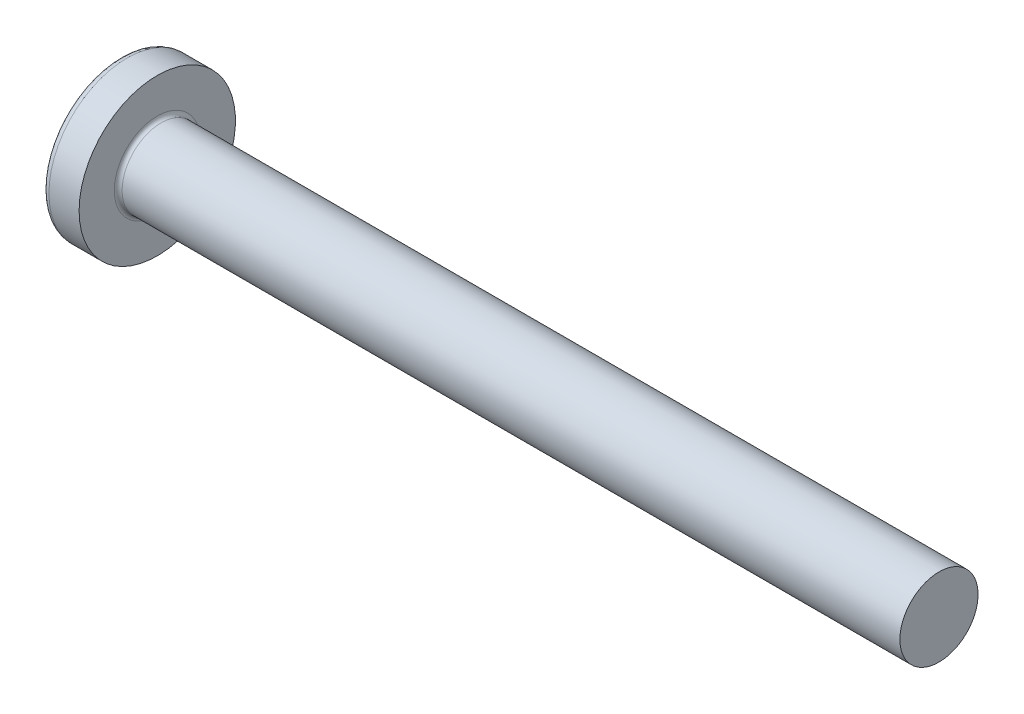
ISO-10303-21;
HEADER;
FILE_DESCRIPTION(('STEP AP214'),'2;1');
FILE_NAME('part.step','',(''),(''),'','','');
FILE_SCHEMA(('AUTOMOTIVE_DESIGN { 1 0 10303 214 1 1 1 1 }'));
ENDSEC;
DATA;
#1=APPLICATION_CONTEXT('core data for automotive mechanical design processes');
#2=APPLICATION_PROTOCOL_DEFINITION('international standard','automotive_design',2000,#1);
#3=PRODUCT_CONTEXT('',#1,'mechanical');
#4=PRODUCT('Part','Part','',(#3));
#5=PRODUCT_RELATED_PRODUCT_CATEGORY('part','',(#4));
#6=PRODUCT_DEFINITION_FORMATION('','',#4);
#7=PRODUCT_DEFINITION_CONTEXT('part definition',#1,'design');
#8=PRODUCT_DEFINITION('design','',#6,#7);
#9=PRODUCT_DEFINITION_SHAPE('','',#8);
#10=(LENGTH_UNIT() NAMED_UNIT(*) SI_UNIT(.MILLI.,.METRE.));
#11=(NAMED_UNIT(*) PLANE_ANGLE_UNIT() SI_UNIT($,.RADIAN.));
#12=(NAMED_UNIT(*) SI_UNIT($,.STERADIAN.) SOLID_ANGLE_UNIT());
#13=UNCERTAINTY_MEASURE_WITH_UNIT(LENGTH_MEASURE(1.E-05),#10,'distance_accuracy_value','');
#14=(GEOMETRIC_REPRESENTATION_CONTEXT(3) GLOBAL_UNCERTAINTY_ASSIGNED_CONTEXT((#13)) GLOBAL_UNIT_ASSIGNED_CONTEXT((#10,
#11,#12)) REPRESENTATION_CONTEXT('',''));
#15=CARTESIAN_POINT('',(0.,0.,0.));
#16=DIRECTION('',(0.,0.,1.));
#17=DIRECTION('',(1.,0.,0.));
#18=AXIS2_PLACEMENT_3D('',#15,#16,#17);
#19=CARTESIAN_POINT('',(6.5,0.,0.));
#20=DIRECTION('',(-1.,0.,0.));
#21=DIRECTION('',(0.,1.,0.));
#22=AXIS2_PLACEMENT_3D('',#19,#20,#21);
#23=SPHERICAL_SURFACE('',#22,6.5);
#24=CARTESIAN_POINT('',(1.26538895452803,0.,0.));
#25=DIRECTION('',(-1.,0.,0.));
#26=DIRECTION('',(0.,0.,1.));
#27=AXIS2_PLACEMENT_3D('',#24,#25,#26);
#28=CIRCLE('',#27,3.85342019543974);
#29=CARTESIAN_POINT('',(1.26538895452803,0.,3.85342019543974));
#30=VERTEX_POINT('',#29);
#31=EDGE_CURVE('E215',#30,#30,#28,.T.);
#32=ORIENTED_EDGE('',*,*,#31,.T.);
#33=EDGE_LOOP('',(#32));
#34=FACE_BOUND('',#33,.T.);
#35=CARTESIAN_POINT('',(0.0788099820016241,0.,0.));
#36=DIRECTION('',(1.,0.,0.));
#37=DIRECTION('',(0.,0.,-1.));
#38=AXIS2_PLACEMENT_3D('',#35,#36,#37);
#39=CIRCLE('',#38,1.0091178091571);
#40=CARTESIAN_POINT('',(0.0788099820016233,-0.514999999999997,-0.867809744562728));
#41=VERTEX_POINT('',#40);
#42=CARTESIAN_POINT('',(0.0788099820016245,-0.867809744562729,-0.515));
#43=VERTEX_POINT('',#42);
#44=EDGE_CURVE('E342',#41,#43,#39,.F.);
#45=ORIENTED_EDGE('',*,*,#44,.F.);
#46=CARTESIAN_POINT('',(6.5,-0.515,0.));
#47=DIRECTION('',(0.,1.,0.));
#48=DIRECTION('',(0.,0.,1.));
#49=AXIS2_PLACEMENT_3D('',#46,#47,#48);
#50=CIRCLE('',#49,6.47956595768575);
#51=CARTESIAN_POINT('',(0.331830520157853,-0.514999999999993,-1.98455543332603));
#52=VERTEX_POINT('',#51);
#53=EDGE_CURVE('E275',#52,#41,#50,.T.);
#54=ORIENTED_EDGE('',*,*,#53,.F.);
#55=CARTESIAN_POINT('',(6.06443225879603,0.,0.873613881878153));
#56=DIRECTION('',(0.446197753347436,0.,-0.894934391398443));
#57=DIRECTION('',(-0.894934391398442,0.,-0.446197753347436));
#58=AXIS2_PLACEMENT_3D('',#55,#56,#57);
#59=CIRCLE('',#58,6.42628038045433);
#60=CARTESIAN_POINT('',(0.331830520157853,0.515000000000007,-1.98455543332603));
#61=VERTEX_POINT('',#60);
#62=EDGE_CURVE('E249',#52,#61,#59,.T.);
#63=ORIENTED_EDGE('',*,*,#62,.T.);
#64=CARTESIAN_POINT('',(6.5,0.515,0.));
#65=DIRECTION('',(0.,-1.,0.));
#66=DIRECTION('',(0.,0.,-1.));
#67=AXIS2_PLACEMENT_3D('',#64,#65,#66);
#68=CIRCLE('',#67,6.47956595768575);
#69=CARTESIAN_POINT('',(0.0788099820016234,0.515000000000003,-0.867809744562724));
#70=VERTEX_POINT('',#69);
#71=EDGE_CURVE('E304',#70,#61,#68,.T.);
#72=ORIENTED_EDGE('',*,*,#71,.F.);
#73=CARTESIAN_POINT('',(0.0788099820016245,0.86780974456273,-0.515));
#74=VERTEX_POINT('',#73);
#75=EDGE_CURVE('E357',#74,#70,#39,.F.);
#76=ORIENTED_EDGE('',*,*,#75,.F.);
#77=CARTESIAN_POINT('',(6.5,0.,-0.515));
#78=DIRECTION('',(0.,0.,1.));
#79=DIRECTION('',(1.,0.,0.));
#80=AXIS2_PLACEMENT_3D('',#77,#78,#79);
#81=CIRCLE('',#80,6.47956595768575);
#82=CARTESIAN_POINT('',(0.331830520157854,1.98455543332603,-0.515));
#83=VERTEX_POINT('',#82);
#84=EDGE_CURVE('E243',#83,#74,#81,.T.);
#85=ORIENTED_EDGE('',*,*,#84,.F.);
#86=CARTESIAN_POINT('',(6.06443225879603,-0.873613881878153,0.));
#87=DIRECTION('',(0.446197753347436,0.894934391398443,0.));
#88=DIRECTION('',(-0.894934391398442,0.446197753347436,0.));
#89=AXIS2_PLACEMENT_3D('',#86,#87,#88);
#90=CIRCLE('',#89,6.42628038045433);
#91=CARTESIAN_POINT('',(0.331830520157854,1.98455543332603,0.515));
#92=VERTEX_POINT('',#91);
#93=EDGE_CURVE('E246',#83,#92,#90,.T.);
#94=ORIENTED_EDGE('',*,*,#93,.T.);
#95=CARTESIAN_POINT('',(6.5,0.,0.515));
#96=DIRECTION('',(0.,0.,-1.));
#97=DIRECTION('',(0.,1.,0.));
#98=AXIS2_PLACEMENT_3D('',#95,#96,#97);
#99=CIRCLE('',#98,6.47956595768575);
#100=CARTESIAN_POINT('',(0.0788099820016245,0.86780974456273,0.515));
#101=VERTEX_POINT('',#100);
#102=EDGE_CURVE('E239',#101,#92,#99,.T.);
#103=ORIENTED_EDGE('',*,*,#102,.F.);
#104=CARTESIAN_POINT('',(0.0788099820016232,0.514999999999997,0.867809744562728));
#105=VERTEX_POINT('',#104);
#106=EDGE_CURVE('E356',#105,#101,#39,.F.);
#107=ORIENTED_EDGE('',*,*,#106,.F.);
#108=CARTESIAN_POINT('',(0.331830520157854,0.514999999999993,1.98455543332604));
#109=VERTEX_POINT('',#108);
#110=EDGE_CURVE('E259',#109,#105,#68,.T.);
#111=ORIENTED_EDGE('',*,*,#110,.F.);
#112=CARTESIAN_POINT('',(6.06443225879603,0.,-0.873613881878153));
#113=DIRECTION('',(0.446197753347436,0.,0.894934391398443));
#114=DIRECTION('',(0.894934391398442,0.,-0.446197753347436));
#115=AXIS2_PLACEMENT_3D('',#112,#113,#114);
#116=CIRCLE('',#115,6.42628038045433);
#117=CARTESIAN_POINT('',(0.331830520157854,-0.515000000000007,1.98455543332603));
#118=VERTEX_POINT('',#117);
#119=EDGE_CURVE('E50',#109,#118,#116,.T.);
#120=ORIENTED_EDGE('',*,*,#119,.T.);
#121=CARTESIAN_POINT('',(0.0788099820016234,-0.515000000000003,0.867809744562724));
#122=VERTEX_POINT('',#121);
#123=EDGE_CURVE('E256',#122,#118,#50,.T.);
#124=ORIENTED_EDGE('',*,*,#123,.F.);
#125=CARTESIAN_POINT('',(0.0788099820016245,-0.867809744562729,0.515));
#126=VERTEX_POINT('',#125);
#127=EDGE_CURVE('E392',#126,#122,#39,.F.);
#128=ORIENTED_EDGE('',*,*,#127,.F.);
#129=CARTESIAN_POINT('',(0.331830520157854,-1.98455543332603,0.515));
#130=VERTEX_POINT('',#129);
#131=EDGE_CURVE('E240',#130,#126,#99,.T.);
#132=ORIENTED_EDGE('',*,*,#131,.F.);
#133=CARTESIAN_POINT('',(6.06443225879604,0.873613881878153,0.));
#134=DIRECTION('',(0.446197753347436,-0.894934391398443,0.));
#135=DIRECTION('',(0.894934391398442,0.446197753347436,0.));
#136=AXIS2_PLACEMENT_3D('',#133,#134,#135);
#137=CIRCLE('',#136,6.42628038045433);
#138=CARTESIAN_POINT('',(0.331830520157854,-1.98455543332603,-0.515));
#139=VERTEX_POINT('',#138);
#140=EDGE_CURVE('E236',#130,#139,#137,.T.);
#141=ORIENTED_EDGE('',*,*,#140,.T.);
#142=EDGE_CURVE('E65',#43,#139,#81,.T.);
#143=ORIENTED_EDGE('',*,*,#142,.F.);
#144=EDGE_LOOP('',(#45,#54,#63,#72,#76,#85,#94,#103,#107,#111,#120,#124,#128,#132,#141,#143));
#145=FACE_BOUND('',#144,.T.);
#146=ADVANCED_FACE('F36',(#34,#145),#23,.T.);
#147=CARTESIAN_POINT('',(0.,2.15,-0.515));
#148=DIRECTION('',(0.,0.,1.));
#149=DIRECTION('',(1.,0.,0.));
#150=AXIS2_PLACEMENT_3D('',#147,#148,#149);
#151=PLANE('',#150);
#152=ORIENTED_EDGE('',*,*,#84,.T.);
#153=CARTESIAN_POINT('',(-1.51195208675156,0.994972220320188,-0.515));
#154=CARTESIAN_POINT('',(-1.2040598194928,0.970722016949958,-0.515));
#155=CARTESIAN_POINT('',(-0.896180907521175,0.946299109919651,-0.515));
#156=CARTESIAN_POINT('',(-0.280449079832186,0.896981122427851,-0.515));
#157=CARTESIAN_POINT('',(0.0274038344396859,0.872086023934883,-0.515));
#158=CARTESIAN_POINT('',(0.48914673951535,0.83429553519528,-0.515));
#159=CARTESIAN_POINT('',(0.643055047553845,0.821624058404092,-0.515));
#160=CARTESIAN_POINT('',(0.950856520197139,0.796108332639504,-0.515));
#161=CARTESIAN_POINT('',(1.10474968487868,0.783264084592466,-0.515));
#162=CARTESIAN_POINT('',(1.41251352095103,0.757376569093378,-0.515));
#163=CARTESIAN_POINT('',(1.56638419296577,0.744333309065218,-0.515));
#164=CARTESIAN_POINT('',(1.87410847343335,0.718013273188896,-0.515));
#165=CARTESIAN_POINT('',(2.02796208151372,0.704736492982792,-0.515));
#166=CARTESIAN_POINT('',(2.36455311890989,0.675386943006726,-0.515));
#167=CARTESIAN_POINT('',(2.54728562293342,0.659257575640986,-0.515));
#168=CARTESIAN_POINT('',(2.91270624109256,0.626517182479888,-0.515));
#169=CARTESIAN_POINT('',(3.09539435554038,0.609906160177238,-0.515));
#170=CARTESIAN_POINT('',(3.46069832191613,0.576073027116421,-0.515));
#171=CARTESIAN_POINT('',(3.64331417870068,0.558850968932727,-0.515));
#172=CARTESIAN_POINT('',(4.00847437496567,0.523604864540037,-0.515));
#173=CARTESIAN_POINT('',(4.19101871216888,0.505580794604253,-0.515));
#174=CARTESIAN_POINT('',(4.55606208157937,0.468429191666488,-0.515));
#175=CARTESIAN_POINT('',(4.73856107358023,0.449301262281853,-0.515));
#176=CARTESIAN_POINT('',(5.10337547353419,0.409473604748924,-0.515));
#177=CARTESIAN_POINT('',(5.28569089526422,0.388774005106069,-0.515));
#178=CARTESIAN_POINT('',(5.55897278495412,0.355828287527264,-0.515));
#179=CARTESIAN_POINT('',(5.65005277419686,0.344527918782738,-0.515));
#180=CARTESIAN_POINT('',(5.83209904103608,0.321075174263031,-0.515));
#181=CARTESIAN_POINT('',(5.92306532397915,0.308922840209686,-0.515));
#182=CARTESIAN_POINT('',(6.10486078872898,0.28342733445193,-0.515));
#183=CARTESIAN_POINT('',(6.1956899229938,0.270083817601714,-0.515));
#184=CARTESIAN_POINT('',(6.33172773785679,0.248701420809951,-0.515));
#185=CARTESIAN_POINT('',(6.37704304473344,0.241345446705304,-0.515));
#186=CARTESIAN_POINT('',(6.4675722520141,0.226018953559338,-0.515));
#187=CARTESIAN_POINT('',(6.51278614568083,0.218048394864476,-0.515));
#188=CARTESIAN_POINT('',(6.55793125759549,0.209691465274944,-0.515));
#189=B_SPLINE_CURVE_WITH_KNOTS('',3,(#153,#154,#155,#156,#157,#158,#159,#160,#161,#162,#163,
#164,#165,#166,#167,#168,#169,#170,#171,#172,#173,#174,#175,#176,#177,#178,#179,#180,#181,#182,
#183,#184,#185,#186,#187,#188),.UNSPECIFIED.,.F.,.F.,(4,2,2,2,2,2,2,2,2,2,2,2,2,2,2,2,2,4),(0.,
0.926537709781721,1.85311087258339,2.31639796016285,2.77968256468771,3.24294992902055,
3.70622594801777,4.25655436065378,4.80687878359543,5.35715597005738,5.90744944680718,
6.45794177197673,7.008389135274,7.28372117336899,7.55903973750591,7.83443833587749,
7.97216007460855,8.10989070671571),.UNSPECIFIED.);
#190=CARTESIAN_POINT('',(2.34,0.677477674908923,-0.515));
#191=VERTEX_POINT('',#190);
#192=EDGE_CURVE('E379',#74,#191,#189,.T.);
#193=ORIENTED_EDGE('',*,*,#192,.T.);
#194=DIRECTION('',(0.,1.,0.));
#195=VECTOR('',#194,1.);
#196=CARTESIAN_POINT('',(2.34,-0.983319232260742,-0.515));
#197=LINE('',#196,#195);
#198=CARTESIAN_POINT('',(2.34,0.983319232260743,-0.515));
#199=VERTEX_POINT('',#198);
#200=EDGE_CURVE('E325',#191,#199,#197,.T.);
#201=ORIENTED_EDGE('',*,*,#200,.T.);
#202=DIRECTION('',(0.894934391398442,-0.446197753347436,0.));
#203=VECTOR('',#202,1.);
#204=CARTESIAN_POINT('',(0.,2.15,-0.515));
#205=LINE('',#204,#203);
#206=EDGE_CURVE('E216',#83,#199,#205,.T.);
#207=ORIENTED_EDGE('',*,*,#206,.F.);
#208=EDGE_LOOP('',(#152,#193,#201,#207));
#209=FACE_BOUND('',#208,.T.);
#210=ADVANCED_FACE('F171',(#209),#151,.T.);
#211=CARTESIAN_POINT('',(2.34,-0.983319232260742,-0.515));
#212=VERTEX_POINT('',#211);
#213=CARTESIAN_POINT('',(2.34,-0.677477674908923,-0.515));
#214=VERTEX_POINT('',#213);
#215=EDGE_CURVE('E224',#212,#214,#197,.T.);
#216=ORIENTED_EDGE('',*,*,#215,.T.);
#217=CARTESIAN_POINT('',(-1.51195208675156,-0.994972220320188,-0.515));
#218=CARTESIAN_POINT('',(-1.2040598194928,-0.970722016949958,-0.515));
#219=CARTESIAN_POINT('',(-0.896180907521175,-0.946299109919651,-0.515));
#220=CARTESIAN_POINT('',(-0.280449079832186,-0.896981122427851,-0.515));
#221=CARTESIAN_POINT('',(0.0274038344396859,-0.872086023934883,-0.515));
#222=CARTESIAN_POINT('',(0.489146739515349,-0.83429553519528,-0.515));
#223=CARTESIAN_POINT('',(0.643055047553845,-0.821624058404092,-0.515));
#224=CARTESIAN_POINT('',(0.950856520197139,-0.796108332639504,-0.515));
#225=CARTESIAN_POINT('',(1.10474968487868,-0.783264084592466,-0.515));
#226=CARTESIAN_POINT('',(1.41251352095103,-0.757376569093378,-0.515));
#227=CARTESIAN_POINT('',(1.56638419296577,-0.744333309065218,-0.515));
#228=CARTESIAN_POINT('',(1.87410847343335,-0.718013273188896,-0.515));
#229=CARTESIAN_POINT('',(2.02796208151372,-0.704736492982792,-0.515));
#230=CARTESIAN_POINT('',(2.36455311890989,-0.675386943006726,-0.515));
#231=CARTESIAN_POINT('',(2.54728562293342,-0.659257575640986,-0.515));
#232=CARTESIAN_POINT('',(2.91270624109256,-0.626517182479888,-0.515));
#233=CARTESIAN_POINT('',(3.09539435554038,-0.609906160177238,-0.515));
#234=CARTESIAN_POINT('',(3.46069832191613,-0.576073027116421,-0.515));
#235=CARTESIAN_POINT('',(3.64331417870068,-0.558850968932727,-0.515));
#236=CARTESIAN_POINT('',(4.00847437496567,-0.523604864540037,-0.515));
#237=CARTESIAN_POINT('',(4.19101871216888,-0.505580794604253,-0.515));
#238=CARTESIAN_POINT('',(4.55606208157937,-0.468429191666488,-0.515));
#239=CARTESIAN_POINT('',(4.73856107358023,-0.449301262281853,-0.515));
#240=CARTESIAN_POINT('',(5.10337547353419,-0.409473604748924,-0.515));
#241=CARTESIAN_POINT('',(5.28569089526422,-0.388774005106069,-0.515));
#242=CARTESIAN_POINT('',(5.55897278495412,-0.355828287527264,-0.515));
#243=CARTESIAN_POINT('',(5.65005277419686,-0.344527918782738,-0.515));
#244=CARTESIAN_POINT('',(5.83209904103608,-0.321075174263031,-0.515));
#245=CARTESIAN_POINT('',(5.92306532397915,-0.308922840209686,-0.515));
#246=CARTESIAN_POINT('',(6.10486078872898,-0.28342733445193,-0.515));
#247=CARTESIAN_POINT('',(6.1956899229938,-0.270083817601714,-0.515));
#248=CARTESIAN_POINT('',(6.3317277378568,-0.24870142080995,-0.515));
#249=CARTESIAN_POINT('',(6.37704304473344,-0.241345446705304,-0.515));
#250=CARTESIAN_POINT('',(6.4675722520141,-0.226018953559337,-0.515));
#251=CARTESIAN_POINT('',(6.51278614568083,-0.218048394864476,-0.515));
#252=CARTESIAN_POINT('',(6.55793125759549,-0.209691465274944,-0.515));
#253=B_SPLINE_CURVE_WITH_KNOTS('',3,(#217,#218,#219,#220,#221,#222,#223,#224,#225,#226,#227,
#228,#229,#230,#231,#232,#233,#234,#235,#236,#237,#238,#239,#240,#241,#242,#243,#244,#245,#246,
#247,#248,#249,#250,#251,#252),.UNSPECIFIED.,.F.,.F.,(4,2,2,2,2,2,2,2,2,2,2,2,2,2,2,2,2,4),(0.,
0.926537709781721,1.85311087258339,2.31639796016285,2.77968256468771,3.24294992902055,
3.70622594801777,4.25655436065378,4.80687878359543,5.35715597005738,5.90744944680718,
6.45794177197674,7.008389135274,7.28372117336899,7.55903973750591,7.83443833587749,
7.97216007460855,8.10989070671572),.UNSPECIFIED.);
#254=EDGE_CURVE('E355',#214,#43,#253,.F.);
#255=ORIENTED_EDGE('',*,*,#254,.T.);
#256=ORIENTED_EDGE('',*,*,#142,.T.);
#257=DIRECTION('',(0.894934391398442,0.446197753347436,0.));
#258=VECTOR('',#257,1.);
#259=CARTESIAN_POINT('',(0.,-2.15,-0.515));
#260=LINE('',#259,#258);
#261=EDGE_CURVE('E307',#139,#212,#260,.T.);
#262=ORIENTED_EDGE('',*,*,#261,.T.);
#263=EDGE_LOOP('',(#216,#255,#256,#262));
#264=FACE_BOUND('',#263,.T.);
#265=ADVANCED_FACE('F177',(#264),#151,.T.);
#266=CARTESIAN_POINT('',(0.,-2.15,0.515));
#267=DIRECTION('',(0.,0.,-1.));
#268=DIRECTION('',(0.,1.,0.));
#269=AXIS2_PLACEMENT_3D('',#266,#267,#268);
#270=PLANE('',#269);
#271=DIRECTION('',(0.,-1.,0.));
#272=VECTOR('',#271,1.);
#273=CARTESIAN_POINT('',(2.34,0.983319232260742,0.515));
#274=LINE('',#273,#272);
#275=CARTESIAN_POINT('',(2.34,0.983319232260743,0.515));
#276=VERTEX_POINT('',#275);
#277=CARTESIAN_POINT('',(2.34,0.677477674908923,0.515));
#278=VERTEX_POINT('',#277);
#279=EDGE_CURVE('E315',#276,#278,#274,.T.);
#280=ORIENTED_EDGE('',*,*,#279,.T.);
#281=CARTESIAN_POINT('',(-1.51195208675156,0.994972220320187,0.515));
#282=CARTESIAN_POINT('',(-1.2040598194928,0.970722016949958,0.515));
#283=CARTESIAN_POINT('',(-0.896180907521175,0.946299109919651,0.515));
#284=CARTESIAN_POINT('',(-0.280449079832187,0.896981122427851,0.515));
#285=CARTESIAN_POINT('',(0.0274038344396859,0.872086023934883,0.515));
#286=CARTESIAN_POINT('',(0.489146739515349,0.83429553519528,0.515));
#287=CARTESIAN_POINT('',(0.643055047553845,0.821624058404092,0.515));
#288=CARTESIAN_POINT('',(0.950856520197139,0.796108332639504,0.515));
#289=CARTESIAN_POINT('',(1.10474968487868,0.783264084592466,0.515));
#290=CARTESIAN_POINT('',(1.41251352095103,0.757376569093378,0.515));
#291=CARTESIAN_POINT('',(1.56638419296577,0.744333309065218,0.515));
#292=CARTESIAN_POINT('',(1.87410847343335,0.718013273188896,0.515));
#293=CARTESIAN_POINT('',(2.02796208151372,0.704736492982792,0.515));
#294=CARTESIAN_POINT('',(2.36455311890989,0.675386943006726,0.515));
#295=CARTESIAN_POINT('',(2.54728562293342,0.659257575640986,0.515));
#296=CARTESIAN_POINT('',(2.91270624109256,0.626517182479888,0.515));
#297=CARTESIAN_POINT('',(3.09539435554038,0.609906160177238,0.515));
#298=CARTESIAN_POINT('',(3.46069832191612,0.576073027116421,0.515));
#299=CARTESIAN_POINT('',(3.64331417870068,0.558850968932727,0.515));
#300=CARTESIAN_POINT('',(4.00847437496567,0.523604864540037,0.515));
#301=CARTESIAN_POINT('',(4.19101871216888,0.505580794604253,0.515));
#302=CARTESIAN_POINT('',(4.55606208157937,0.468429191666488,0.515));
#303=CARTESIAN_POINT('',(4.73856107358022,0.449301262281854,0.515));
#304=CARTESIAN_POINT('',(5.10337547353418,0.409473604748925,0.515));
#305=CARTESIAN_POINT('',(5.28569089526422,0.38877400510607,0.515));
#306=CARTESIAN_POINT('',(5.55897278495412,0.355828287527264,0.515));
#307=CARTESIAN_POINT('',(5.65005277419686,0.344527918782739,0.515));
#308=CARTESIAN_POINT('',(5.83209904103607,0.321075174263031,0.515));
#309=CARTESIAN_POINT('',(5.92306532397915,0.308922840209686,0.515));
#310=CARTESIAN_POINT('',(6.10486078872898,0.28342733445193,0.515));
#311=CARTESIAN_POINT('',(6.1956899229938,0.270083817601714,0.515));
#312=CARTESIAN_POINT('',(6.33172773785679,0.248701420809951,0.515));
#313=CARTESIAN_POINT('',(6.37704304473344,0.241345446705304,0.515));
#314=CARTESIAN_POINT('',(6.4675722520141,0.226018953559338,0.515));
#315=CARTESIAN_POINT('',(6.51278614568083,0.218048394864476,0.515));
#316=CARTESIAN_POINT('',(6.55793125759549,0.209691465274945,0.515));
#317=B_SPLINE_CURVE_WITH_KNOTS('',3,(#281,#282,#283,#284,#285,#286,#287,#288,#289,#290,#291,
#292,#293,#294,#295,#296,#297,#298,#299,#300,#301,#302,#303,#304,#305,#306,#307,#308,#309,#310,
#311,#312,#313,#314,#315,#316),.UNSPECIFIED.,.F.,.F.,(4,2,2,2,2,2,2,2,2,2,2,2,2,2,2,2,2,4),(0.,
0.926537709781721,1.85311087258339,2.31639796016285,2.77968256468771,3.24294992902055,
3.70622594801777,4.25655436065378,4.80687878359543,5.35715597005738,5.90744944680718,
6.45794177197673,7.008389135274,7.28372117336899,7.55903973750591,7.83443833587749,
7.97216007460855,8.10989070671571),.UNSPECIFIED.);
#318=EDGE_CURVE('E280',#278,#101,#317,.F.);
#319=ORIENTED_EDGE('',*,*,#318,.T.);
#320=ORIENTED_EDGE('',*,*,#102,.T.);
#321=DIRECTION('',(0.894934391398442,-0.446197753347436,0.));
#322=VECTOR('',#321,1.);
#323=CARTESIAN_POINT('',(0.,2.15,0.515));
#324=LINE('',#323,#322);
#325=EDGE_CURVE('E221',#92,#276,#324,.T.);
#326=ORIENTED_EDGE('',*,*,#325,.T.);
#327=EDGE_LOOP('',(#280,#319,#320,#326));
#328=FACE_BOUND('',#327,.T.);
#329=ADVANCED_FACE('F375',(#328),#270,.T.);
#330=ORIENTED_EDGE('',*,*,#131,.T.);
#331=CARTESIAN_POINT('',(-1.51195208675156,-0.994972220320188,0.515));
#332=CARTESIAN_POINT('',(-1.2040598194928,-0.970722016949958,0.515));
#333=CARTESIAN_POINT('',(-0.896180907521175,-0.946299109919651,0.515));
#334=CARTESIAN_POINT('',(-0.280449079832186,-0.896981122427852,0.515));
#335=CARTESIAN_POINT('',(0.0274038344396859,-0.872086023934883,0.515));
#336=CARTESIAN_POINT('',(0.48914673951535,-0.83429553519528,0.515));
#337=CARTESIAN_POINT('',(0.643055047553845,-0.821624058404092,0.515));
#338=CARTESIAN_POINT('',(0.950856520197139,-0.796108332639504,0.515));
#339=CARTESIAN_POINT('',(1.10474968487868,-0.783264084592466,0.515));
#340=CARTESIAN_POINT('',(1.41251352095103,-0.757376569093379,0.515));
#341=CARTESIAN_POINT('',(1.56638419296577,-0.744333309065218,0.515));
#342=CARTESIAN_POINT('',(1.87410847343335,-0.718013273188896,0.515));
#343=CARTESIAN_POINT('',(2.02796208151372,-0.704736492982792,0.515));
#344=CARTESIAN_POINT('',(2.36455311890989,-0.675386943006726,0.515));
#345=CARTESIAN_POINT('',(2.54728562293342,-0.659257575640986,0.515));
#346=CARTESIAN_POINT('',(2.91270624109256,-0.626517182479888,0.515));
#347=CARTESIAN_POINT('',(3.09539435554038,-0.609906160177238,0.515));
#348=CARTESIAN_POINT('',(3.46069832191613,-0.576073027116422,0.515));
#349=CARTESIAN_POINT('',(3.64331417870068,-0.558850968932728,0.515));
#350=CARTESIAN_POINT('',(4.00847437496567,-0.523604864540037,0.515));
#351=CARTESIAN_POINT('',(4.19101871216888,-0.505580794604253,0.515));
#352=CARTESIAN_POINT('',(4.55606208157937,-0.468429191666488,0.515));
#353=CARTESIAN_POINT('',(4.73856107358023,-0.449301262281854,0.515));
#354=CARTESIAN_POINT('',(5.10337547353419,-0.409473604748924,0.515));
#355=CARTESIAN_POINT('',(5.28569089526422,-0.38877400510607,0.515));
#356=CARTESIAN_POINT('',(5.55897278495412,-0.355828287527264,0.515));
#357=CARTESIAN_POINT('',(5.65005277419686,-0.344527918782739,0.515));
#358=CARTESIAN_POINT('',(5.83209904103608,-0.321075174263031,0.515));
#359=CARTESIAN_POINT('',(5.92306532397915,-0.308922840209686,0.515));
#360=CARTESIAN_POINT('',(6.10486078872898,-0.28342733445193,0.515));
#361=CARTESIAN_POINT('',(6.1956899229938,-0.270083817601714,0.515));
#362=CARTESIAN_POINT('',(6.33172773785679,-0.248701420809951,0.515));
#363=CARTESIAN_POINT('',(6.37704304473344,-0.241345446705304,0.515));
#364=CARTESIAN_POINT('',(6.4675722520141,-0.226018953559338,0.515));
#365=CARTESIAN_POINT('',(6.51278614568083,-0.218048394864477,0.515));
#366=CARTESIAN_POINT('',(6.55793125759549,-0.209691465274945,0.515));
#367=B_SPLINE_CURVE_WITH_KNOTS('',3,(#331,#332,#333,#334,#335,#336,#337,#338,#339,#340,#341,
#342,#343,#344,#345,#346,#347,#348,#349,#350,#351,#352,#353,#354,#355,#356,#357,#358,#359,#360,
#361,#362,#363,#364,#365,#366),.UNSPECIFIED.,.F.,.F.,(4,2,2,2,2,2,2,2,2,2,2,2,2,2,2,2,2,4),(0.,
0.926537709781721,1.85311087258339,2.31639796016285,2.77968256468771,3.24294992902055,
3.70622594801777,4.25655436065378,4.80687878359543,5.35715597005738,5.90744944680718,
6.45794177197673,7.008389135274,7.28372117336899,7.55903973750591,7.83443833587749,
7.97216007460855,8.10989070671571),.UNSPECIFIED.);
#368=CARTESIAN_POINT('',(2.34,-0.677477674908923,0.515));
#369=VERTEX_POINT('',#368);
#370=EDGE_CURVE('E393',#126,#369,#367,.T.);
#371=ORIENTED_EDGE('',*,*,#370,.T.);
#372=CARTESIAN_POINT('',(2.34,-0.983319232260742,0.515));
#373=VERTEX_POINT('',#372);
#374=EDGE_CURVE('E317',#369,#373,#274,.T.);
#375=ORIENTED_EDGE('',*,*,#374,.T.);
#376=DIRECTION('',(0.894934391398442,0.446197753347436,0.));
#377=VECTOR('',#376,1.);
#378=CARTESIAN_POINT('',(0.,-2.15,0.515));
#379=LINE('',#378,#377);
#380=EDGE_CURVE('E309',#130,#373,#379,.T.);
#381=ORIENTED_EDGE('',*,*,#380,.F.);
#382=EDGE_LOOP('',(#330,#371,#375,#381));
#383=FACE_BOUND('',#382,.T.);
#384=ADVANCED_FACE('F423',(#383),#270,.T.);
#385=CARTESIAN_POINT('',(2.34,0.983319232260742,-0.515));
#386=DIRECTION('',(-1.,0.,0.));
#387=DIRECTION('',(0.,0.,1.));
#388=AXIS2_PLACEMENT_3D('',#385,#386,#387);
#389=PLANE('',#388);
#390=ORIENTED_EDGE('',*,*,#374,.F.);
#391=CARTESIAN_POINT('',(2.34,0.,0.));
#392=DIRECTION('',(-1.,0.,0.));
#393=DIRECTION('',(0.,0.,1.));
#394=AXIS2_PLACEMENT_3D('',#391,#392,#393);
#395=CIRCLE('',#394,0.851);
#396=EDGE_CURVE('E350',#214,#369,#395,.T.);
#397=ORIENTED_EDGE('',*,*,#396,.F.);
#398=ORIENTED_EDGE('',*,*,#215,.F.);
#399=DIRECTION('',(0.,0.,1.));
#400=VECTOR('',#399,1.);
#401=CARTESIAN_POINT('',(2.34,-0.983319232260742,-0.515));
#402=LINE('',#401,#400);
#403=EDGE_CURVE('E312',#212,#373,#402,.T.);
#404=ORIENTED_EDGE('',*,*,#403,.T.);
#405=EDGE_LOOP('',(#390,#397,#398,#404));
#406=FACE_BOUND('',#405,.T.);
#407=ADVANCED_FACE('F416',(#406),#389,.T.);
#408=DIRECTION('',(0.,0.,-1.));
#409=VECTOR('',#408,1.);
#410=CARTESIAN_POINT('',(2.34,-0.515000000000004,0.983319232260741));
#411=LINE('',#410,#409);
#412=CARTESIAN_POINT('',(2.34,-0.514999999999998,-0.677477674908925));
#413=VERTEX_POINT('',#412);
#414=CARTESIAN_POINT('',(2.34,-0.514999999999996,-0.983319232260744));
#415=VERTEX_POINT('',#414);
#416=EDGE_CURVE('E298',#413,#415,#411,.T.);
#417=ORIENTED_EDGE('',*,*,#416,.F.);
#418=CARTESIAN_POINT('',(2.34,0.515000000000002,-0.677477674908921));
#419=VERTEX_POINT('',#418);
#420=EDGE_CURVE('E57',#419,#413,#395,.T.);
#421=ORIENTED_EDGE('',*,*,#420,.F.);
#422=DIRECTION('',(0.,0.,1.));
#423=VECTOR('',#422,1.);
#424=CARTESIAN_POINT('',(2.34,0.515000000000004,-0.983319232260741));
#425=LINE('',#424,#423);
#426=CARTESIAN_POINT('',(2.34,0.515000000000004,-0.983319232260741));
#427=VERTEX_POINT('',#426);
#428=EDGE_CURVE('E301',#427,#419,#425,.T.);
#429=ORIENTED_EDGE('',*,*,#428,.F.);
#430=DIRECTION('',(0.,-1.,0.));
#431=VECTOR('',#430,1.);
#432=CARTESIAN_POINT('',(2.34,0.515000000000004,-0.983319232260741));
#433=LINE('',#432,#431);
#434=EDGE_CURVE('E292',#427,#415,#433,.T.);
#435=ORIENTED_EDGE('',*,*,#434,.T.);
#436=EDGE_LOOP('',(#417,#421,#429,#435));
#437=FACE_BOUND('',#436,.T.);
#438=ADVANCED_FACE('F345',(#437),#389,.T.);
#439=ORIENTED_EDGE('',*,*,#200,.F.);
#440=EDGE_CURVE('E349',#278,#191,#395,.T.);
#441=ORIENTED_EDGE('',*,*,#440,.F.);
#442=ORIENTED_EDGE('',*,*,#279,.F.);
#443=DIRECTION('',(0.,0.,-1.));
#444=VECTOR('',#443,1.);
#445=CARTESIAN_POINT('',(2.34,0.983319232260742,0.515));
#446=LINE('',#445,#444);
#447=EDGE_CURVE('E318',#276,#199,#446,.T.);
#448=ORIENTED_EDGE('',*,*,#447,.T.);
#449=EDGE_LOOP('',(#439,#441,#442,#448));
#450=FACE_BOUND('',#449,.T.);
#451=ADVANCED_FACE('F417',(#450),#389,.T.);
#452=CARTESIAN_POINT('',(0.,0.514999999999993,2.15));
#453=DIRECTION('',(0.,-1.,0.));
#454=DIRECTION('',(1.,0.,0.));
#455=AXIS2_PLACEMENT_3D('',#452,#453,#454);
#456=PLANE('',#455);
#457=ORIENTED_EDGE('',*,*,#110,.T.);
#458=CARTESIAN_POINT('',(-1.51195208754038,0.514999999999997,0.994972220382299));
#459=CARTESIAN_POINT('',(-1.20405982018868,0.514999999999997,0.970722017005066));
#460=CARTESIAN_POINT('',(-0.896180908124145,0.514999999999997,0.94629910996769));
#461=CARTESIAN_POINT('',(-0.280449080249314,0.514999999999997,0.896981122461529));
#462=CARTESIAN_POINT('',(0.0274038341154839,0.514999999999997,0.872086023961266));
#463=CARTESIAN_POINT('',(0.489146739371407,0.514999999999997,0.834295535207138));
#464=CARTESIAN_POINT('',(0.643055047497244,0.514999999999997,0.821624058408798));
#465=CARTESIAN_POINT('',(0.950856520315202,0.514999999999997,0.796108332629707));
#466=CARTESIAN_POINT('',(1.10474968508407,0.514999999999997,0.783264084575319));
#467=CARTESIAN_POINT('',(1.41251352133103,0.514999999999997,0.757376569061289));
#468=CARTESIAN_POINT('',(1.56638419343305,0.514999999999997,0.744333309025536));
#469=CARTESIAN_POINT('',(1.87410847407519,0.514999999999998,0.718013273133717));
#470=CARTESIAN_POINT('',(2.02796208224283,0.514999999999998,0.704736492919711));
#471=CARTESIAN_POINT('',(2.36455311972626,0.514999999999998,0.675386942934957));
#472=CARTESIAN_POINT('',(2.5472856237498,0.514999999999998,0.65925757556857));
#473=CARTESIAN_POINT('',(2.91270624190895,0.514999999999998,0.626517182406015));
#474=CARTESIAN_POINT('',(3.09539435635676,0.514999999999998,0.609906160102556));
#475=CARTESIAN_POINT('',(3.46069832273244,0.514999999999998,0.576073027039891));
#476=CARTESIAN_POINT('',(3.64331417951694,0.514999999999998,0.558850968855158));
#477=CARTESIAN_POINT('',(4.00847437578178,0.514999999999998,0.523604864460046));
#478=CARTESIAN_POINT('',(4.1910187129849,0.514999999999998,0.505580794522878));
#479=CARTESIAN_POINT('',(4.55606208239526,0.514999999999998,0.468429191581782));
#480=CARTESIAN_POINT('',(4.73856107439606,0.514999999999999,0.4493012621952));
#481=CARTESIAN_POINT('',(5.10337547434977,0.514999999999999,0.409473604657437));
#482=CARTESIAN_POINT('',(5.28569089607961,0.514999999999999,0.388774005011696));
#483=CARTESIAN_POINT('',(5.55897278576906,0.514999999999999,0.355828287427084));
#484=CARTESIAN_POINT('',(5.65005277501166,0.514999999999999,0.344527918680371));
#485=CARTESIAN_POINT('',(5.83209904185046,0.514999999999999,0.321075174155502));
#486=CARTESIAN_POINT('',(5.92306532479326,0.514999999999999,0.308922840099183));
#487=CARTESIAN_POINT('',(6.10486078954238,0.514999999999999,0.283427334334154));
#488=CARTESIAN_POINT('',(6.19568992380676,0.514999999999999,0.270083817479639));
#489=CARTESIAN_POINT('',(6.33172773866874,0.514999999999999,0.248701420679481));
#490=CARTESIAN_POINT('',(6.377043045545,0.514999999999999,0.241345446571709));
#491=CARTESIAN_POINT('',(6.46757225282465,0.514999999999999,0.226018953418426));
#492=CARTESIAN_POINT('',(6.51278614649077,0.514999999999999,0.218048394719371));
#493=CARTESIAN_POINT('',(6.55793125840465,0.514999999999999,0.209691465124903));
#494=B_SPLINE_CURVE_WITH_KNOTS('',3,(#458,#459,#460,#461,#462,#463,#464,#465,#466,#467,#468,
#469,#470,#471,#472,#473,#474,#475,#476,#477,#478,#479,#480,#481,#482,#483,#484,#485,#486,#487,
#488,#489,#490,#491,#492,#493),.UNSPECIFIED.,.F.,.F.,(4,2,2,2,2,2,2,2,2,2,2,2,2,2,2,2,2,4),(0.,
0.926537710061278,1.85311087314258,2.31639796098494,2.77968256577269,3.24294993036838,
3.70622594962848,4.2565543622647,4.80687878520654,5.3571559716686,5.90744944841855,
6.45794177358856,7.00838913688619,7.28372117498157,7.55903973911884,7.83443833749096,
7.97216007622236,8.10989070832989),.UNSPECIFIED.);
#495=CARTESIAN_POINT('',(2.34,0.514999999999998,0.677477674908924));
#496=VERTEX_POINT('',#495);
#497=EDGE_CURVE('E441',#105,#496,#494,.T.);
#498=ORIENTED_EDGE('',*,*,#497,.T.);
#499=CARTESIAN_POINT('',(2.34,0.514999999999997,0.983319232260744));
#500=VERTEX_POINT('',#499);
#501=EDGE_CURVE('E273',#496,#500,#425,.T.);
#502=ORIENTED_EDGE('',*,*,#501,.T.);
#503=DIRECTION('',(0.894934391398442,0.,-0.446197753347436));
#504=VECTOR('',#503,1.);
#505=CARTESIAN_POINT('',(0.,0.514999999999993,2.15));
#506=LINE('',#505,#504);
#507=EDGE_CURVE('E266',#109,#500,#506,.T.);
#508=ORIENTED_EDGE('',*,*,#507,.F.);
#509=EDGE_LOOP('',(#457,#498,#502,#508));
#510=FACE_BOUND('',#509,.T.);
#511=ADVANCED_FACE('F270',(#510),#456,.T.);
#512=CARTESIAN_POINT('',(0.,-0.514999999999992,-2.15));
#513=DIRECTION('',(0.,1.,0.));
#514=DIRECTION('',(0.,0.,1.));
#515=AXIS2_PLACEMENT_3D('',#512,#513,#514);
#516=PLANE('',#515);
#517=CARTESIAN_POINT('',(2.34,-0.515000000000004,0.983319232260741));
#518=VERTEX_POINT('',#517);
#519=CARTESIAN_POINT('',(2.34,-0.515000000000003,0.677477674908921));
#520=VERTEX_POINT('',#519);
#521=EDGE_CURVE('E295',#518,#520,#411,.T.);
#522=ORIENTED_EDGE('',*,*,#521,.T.);
#523=CARTESIAN_POINT('',(-1.51195208754038,-0.515000000000004,0.994972220382296));
#524=CARTESIAN_POINT('',(-1.20405982018868,-0.515000000000004,0.970722017005062));
#525=CARTESIAN_POINT('',(-0.896180908124145,-0.515000000000004,0.946299109967687));
#526=CARTESIAN_POINT('',(-0.280449080249314,-0.515000000000003,0.896981122461525));
#527=CARTESIAN_POINT('',(0.0274038341154835,-0.515000000000003,0.872086023961263));
#528=CARTESIAN_POINT('',(0.489146739371407,-0.515000000000003,0.834295535207134));
#529=CARTESIAN_POINT('',(0.643055047497243,-0.515000000000003,0.821624058408794));
#530=CARTESIAN_POINT('',(0.950856520315202,-0.515000000000003,0.796108332629704));
#531=CARTESIAN_POINT('',(1.10474968508407,-0.515000000000003,0.783264084575316));
#532=CARTESIAN_POINT('',(1.41251352133103,-0.515000000000003,0.757376569061286));
#533=CARTESIAN_POINT('',(1.56638419343305,-0.515000000000003,0.744333309025532));
#534=CARTESIAN_POINT('',(1.87410847407519,-0.515000000000003,0.718013273133714));
#535=CARTESIAN_POINT('',(2.02796208224282,-0.515000000000003,0.704736492919708));
#536=CARTESIAN_POINT('',(2.36455311972626,-0.515000000000002,0.675386942934954));
#537=CARTESIAN_POINT('',(2.5472856237498,-0.515000000000002,0.659257575568566));
#538=CARTESIAN_POINT('',(2.91270624190895,-0.515000000000002,0.626517182406012));
#539=CARTESIAN_POINT('',(3.09539435635676,-0.515000000000002,0.609906160102553));
#540=CARTESIAN_POINT('',(3.46069832273244,-0.515000000000002,0.576073027039887));
#541=CARTESIAN_POINT('',(3.64331417951694,-0.515000000000002,0.558850968855155));
#542=CARTESIAN_POINT('',(4.00847437578178,-0.515000000000002,0.523604864460042));
#543=CARTESIAN_POINT('',(4.1910187129849,-0.515000000000002,0.505580794522874));
#544=CARTESIAN_POINT('',(4.55606208239526,-0.515000000000002,0.468429191581778));
#545=CARTESIAN_POINT('',(4.73856107439606,-0.515000000000002,0.449301262195196));
#546=CARTESIAN_POINT('',(5.10337547434977,-0.515000000000001,0.409473604657433));
#547=CARTESIAN_POINT('',(5.28569089607961,-0.515000000000001,0.388774005011693));
#548=CARTESIAN_POINT('',(5.55897278576906,-0.515000000000001,0.355828287427081));
#549=CARTESIAN_POINT('',(5.65005277501166,-0.515000000000001,0.344527918680367));
#550=CARTESIAN_POINT('',(5.83209904185046,-0.515000000000001,0.321075174155498));
#551=CARTESIAN_POINT('',(5.92306532479326,-0.515000000000001,0.308922840099179));
#552=CARTESIAN_POINT('',(6.10486078954238,-0.515000000000001,0.283427334334151));
#553=CARTESIAN_POINT('',(6.19568992380676,-0.515000000000001,0.270083817479636));
#554=CARTESIAN_POINT('',(6.33172773866873,-0.515000000000001,0.248701420679478));
#555=CARTESIAN_POINT('',(6.37704304554499,-0.515000000000001,0.241345446571706));
#556=CARTESIAN_POINT('',(6.46757225282465,-0.515000000000001,0.226018953418422));
#557=CARTESIAN_POINT('',(6.51278614649077,-0.515000000000001,0.218048394719367));
#558=CARTESIAN_POINT('',(6.55793125840465,-0.515000000000001,0.2096914651249));
#559=B_SPLINE_CURVE_WITH_KNOTS('',3,(#523,#524,#525,#526,#527,#528,#529,#530,#531,#532,#533,
#534,#535,#536,#537,#538,#539,#540,#541,#542,#543,#544,#545,#546,#547,#548,#549,#550,#551,#552,
#553,#554,#555,#556,#557,#558),.UNSPECIFIED.,.F.,.F.,(4,2,2,2,2,2,2,2,2,2,2,2,2,2,2,2,2,4),(0.,
0.926537710061278,1.85311087314258,2.31639796098494,2.77968256577269,3.24294993036838,
3.70622594962848,4.2565543622647,4.80687878520654,5.3571559716686,5.90744944841855,
6.45794177358856,7.00838913688619,7.28372117498157,7.55903973911884,7.83443833749096,
7.97216007622236,8.10989070832989),.UNSPECIFIED.);
#560=EDGE_CURVE('E385',#520,#122,#559,.F.);
#561=ORIENTED_EDGE('',*,*,#560,.T.);
#562=ORIENTED_EDGE('',*,*,#123,.T.);
#563=DIRECTION('',(0.894934391398442,0.,-0.446197753347436));
#564=VECTOR('',#563,1.);
#565=CARTESIAN_POINT('',(0.,-0.515000000000008,2.15));
#566=LINE('',#565,#564);
#567=EDGE_CURVE('E268',#118,#518,#566,.T.);
#568=ORIENTED_EDGE('',*,*,#567,.T.);
#569=EDGE_LOOP('',(#522,#561,#562,#568));
#570=FACE_BOUND('',#569,.T.);
#571=ADVANCED_FACE('F206',(#570),#516,.T.);
#572=ORIENTED_EDGE('',*,*,#428,.T.);
#573=CARTESIAN_POINT('',(-1.51195208754038,0.515000000000004,-0.994972220382296));
#574=CARTESIAN_POINT('',(-1.20405982018868,0.515000000000003,-0.970722017005062));
#575=CARTESIAN_POINT('',(-0.896180908124145,0.515000000000003,-0.946299109967687));
#576=CARTESIAN_POINT('',(-0.280449080249314,0.515000000000003,-0.896981122461525));
#577=CARTESIAN_POINT('',(0.0274038341154835,0.515000000000003,-0.872086023961263));
#578=CARTESIAN_POINT('',(0.489146739371407,0.515000000000003,-0.834295535207134));
#579=CARTESIAN_POINT('',(0.643055047497243,0.515000000000003,-0.821624058408794));
#580=CARTESIAN_POINT('',(0.950856520315202,0.515000000000003,-0.796108332629704));
#581=CARTESIAN_POINT('',(1.10474968508407,0.515000000000003,-0.783264084575316));
#582=CARTESIAN_POINT('',(1.41251352133103,0.515000000000003,-0.757376569061286));
#583=CARTESIAN_POINT('',(1.56638419343305,0.515000000000003,-0.744333309025532));
#584=CARTESIAN_POINT('',(1.87410847407519,0.515000000000003,-0.718013273133714));
#585=CARTESIAN_POINT('',(2.02796208224282,0.515000000000002,-0.704736492919708));
#586=CARTESIAN_POINT('',(2.36455311972626,0.515000000000002,-0.675386942934954));
#587=CARTESIAN_POINT('',(2.5472856237498,0.515000000000002,-0.659257575568566));
#588=CARTESIAN_POINT('',(2.91270624190895,0.515000000000002,-0.626517182406012));
#589=CARTESIAN_POINT('',(3.09539435635676,0.515000000000002,-0.609906160102553));
#590=CARTESIAN_POINT('',(3.46069832273244,0.515000000000002,-0.576073027039887));
#591=CARTESIAN_POINT('',(3.64331417951694,0.515000000000002,-0.558850968855155));
#592=CARTESIAN_POINT('',(4.00847437578178,0.515000000000002,-0.523604864460042));
#593=CARTESIAN_POINT('',(4.1910187129849,0.515000000000002,-0.505580794522874));
#594=CARTESIAN_POINT('',(4.55606208239526,0.515000000000002,-0.468429191581778));
#595=CARTESIAN_POINT('',(4.73856107439606,0.515000000000002,-0.449301262195196));
#596=CARTESIAN_POINT('',(5.10337547434977,0.515000000000001,-0.409473604657433));
#597=CARTESIAN_POINT('',(5.28569089607961,0.515000000000001,-0.388774005011693));
#598=CARTESIAN_POINT('',(5.55897278576906,0.515000000000001,-0.355828287427081));
#599=CARTESIAN_POINT('',(5.65005277501166,0.515000000000001,-0.344527918680367));
#600=CARTESIAN_POINT('',(5.83209904185046,0.515000000000001,-0.321075174155498));
#601=CARTESIAN_POINT('',(5.92306532479326,0.515000000000001,-0.308922840099179));
#602=CARTESIAN_POINT('',(6.10486078954238,0.515000000000001,-0.283427334334151));
#603=CARTESIAN_POINT('',(6.19568992380676,0.515000000000001,-0.270083817479636));
#604=CARTESIAN_POINT('',(6.33172773866873,0.515000000000001,-0.248701420679477));
#605=CARTESIAN_POINT('',(6.37704304554499,0.515000000000001,-0.241345446571706));
#606=CARTESIAN_POINT('',(6.46757225282465,0.515000000000001,-0.226018953418422));
#607=CARTESIAN_POINT('',(6.51278614649077,0.515000000000001,-0.218048394719367));
#608=CARTESIAN_POINT('',(6.55793125840465,0.515000000000001,-0.2096914651249));
#609=B_SPLINE_CURVE_WITH_KNOTS('',3,(#573,#574,#575,#576,#577,#578,#579,#580,#581,#582,#583,
#584,#585,#586,#587,#588,#589,#590,#591,#592,#593,#594,#595,#596,#597,#598,#599,#600,#601,#602,
#603,#604,#605,#606,#607,#608),.UNSPECIFIED.,.F.,.F.,(4,2,2,2,2,2,2,2,2,2,2,2,2,2,2,2,2,4),(0.,
0.926537710061278,1.85311087314258,2.31639796098494,2.77968256577269,3.24294993036838,
3.70622594962848,4.2565543622647,4.80687878520654,5.3571559716686,5.90744944841855,
6.45794177358856,7.00838913688619,7.28372117498157,7.55903973911884,7.83443833749096,
7.97216007622236,8.10989070832989),.UNSPECIFIED.);
#610=EDGE_CURVE('E334',#419,#70,#609,.F.);
#611=ORIENTED_EDGE('',*,*,#610,.T.);
#612=ORIENTED_EDGE('',*,*,#71,.T.);
#613=DIRECTION('',(0.894934391398442,0.,0.446197753347436));
#614=VECTOR('',#613,1.);
#615=CARTESIAN_POINT('',(0.,0.515000000000008,-2.15));
#616=LINE('',#615,#614);
#617=EDGE_CURVE('E277',#61,#427,#616,.T.);
#618=ORIENTED_EDGE('',*,*,#617,.T.);
#619=EDGE_LOOP('',(#572,#611,#612,#618));
#620=FACE_BOUND('',#619,.T.);
#621=ADVANCED_FACE('F204',(#620),#456,.T.);
#622=ORIENTED_EDGE('',*,*,#53,.T.);
#623=CARTESIAN_POINT('',(-1.51195208675156,-0.514999999999996,-0.994972220320189));
#624=CARTESIAN_POINT('',(-1.2040598194928,-0.514999999999997,-0.97072201694996));
#625=CARTESIAN_POINT('',(-0.896180907521175,-0.514999999999997,-0.946299109919653));
#626=CARTESIAN_POINT('',(-0.280449079832186,-0.514999999999997,-0.896981122427853));
#627=CARTESIAN_POINT('',(0.027403834439686,-0.514999999999997,-0.872086023934885));
#628=CARTESIAN_POINT('',(0.48914673951535,-0.514999999999997,-0.834295535195282));
#629=CARTESIAN_POINT('',(0.643055047553845,-0.514999999999997,-0.821624058404094));
#630=CARTESIAN_POINT('',(0.95085652019714,-0.514999999999997,-0.796108332639506));
#631=CARTESIAN_POINT('',(1.10474968487868,-0.514999999999997,-0.783264084592467));
#632=CARTESIAN_POINT('',(1.41251352095103,-0.514999999999997,-0.75737656909338));
#633=CARTESIAN_POINT('',(1.56638419296577,-0.514999999999997,-0.74433330906522));
#634=CARTESIAN_POINT('',(1.87410847343335,-0.514999999999997,-0.718013273188898));
#635=CARTESIAN_POINT('',(2.02796208151372,-0.514999999999997,-0.704736492982794));
#636=CARTESIAN_POINT('',(2.36455311890989,-0.514999999999998,-0.675386943006728));
#637=CARTESIAN_POINT('',(2.54728562293342,-0.514999999999998,-0.659257575640988));
#638=CARTESIAN_POINT('',(2.91270624109256,-0.514999999999998,-0.62651718247989));
#639=CARTESIAN_POINT('',(3.09539435554038,-0.514999999999998,-0.60990616017724));
#640=CARTESIAN_POINT('',(3.46069832191613,-0.514999999999998,-0.576073027116423));
#641=CARTESIAN_POINT('',(3.64331417870068,-0.514999999999998,-0.558850968932729));
#642=CARTESIAN_POINT('',(4.00847437496567,-0.514999999999998,-0.523604864540039));
#643=CARTESIAN_POINT('',(4.19101871216888,-0.514999999999998,-0.505580794604255));
#644=CARTESIAN_POINT('',(4.55606208157937,-0.514999999999998,-0.46842919166649));
#645=CARTESIAN_POINT('',(4.73856107358023,-0.514999999999998,-0.449301262281856));
#646=CARTESIAN_POINT('',(5.10337547353419,-0.514999999999999,-0.409473604748926));
#647=CARTESIAN_POINT('',(5.28569089526422,-0.514999999999999,-0.388774005106071));
#648=CARTESIAN_POINT('',(5.55897278495412,-0.514999999999999,-0.355828287527266));
#649=CARTESIAN_POINT('',(5.65005277419686,-0.514999999999999,-0.34452791878274));
#650=CARTESIAN_POINT('',(5.83209904103608,-0.514999999999999,-0.321075174263033));
#651=CARTESIAN_POINT('',(5.92306532397915,-0.514999999999999,-0.308922840209688));
#652=CARTESIAN_POINT('',(6.10486078872898,-0.514999999999999,-0.283427334451932));
#653=CARTESIAN_POINT('',(6.1956899229938,-0.514999999999999,-0.270083817601717));
#654=CARTESIAN_POINT('',(6.33172773785679,-0.514999999999999,-0.248701420809953));
#655=CARTESIAN_POINT('',(6.37704304473344,-0.514999999999999,-0.241345446705306));
#656=CARTESIAN_POINT('',(6.4675722520141,-0.514999999999999,-0.22601895355934));
#657=CARTESIAN_POINT('',(6.51278614568083,-0.514999999999999,-0.218048394864478));
#658=CARTESIAN_POINT('',(6.55793125759549,-0.514999999999999,-0.209691465274947));
#659=B_SPLINE_CURVE_WITH_KNOTS('',3,(#623,#624,#625,#626,#627,#628,#629,#630,#631,#632,#633,
#634,#635,#636,#637,#638,#639,#640,#641,#642,#643,#644,#645,#646,#647,#648,#649,#650,#651,#652,
#653,#654,#655,#656,#657,#658),.UNSPECIFIED.,.F.,.F.,(4,2,2,2,2,2,2,2,2,2,2,2,2,2,2,2,2,4),(0.,
0.926537709781721,1.85311087258339,2.31639796016285,2.77968256468771,3.24294992902054,
3.70622594801777,4.25655436065378,4.80687878359543,5.35715597005738,5.90744944680718,
6.45794177197673,7.008389135274,7.28372117336899,7.55903973750591,7.83443833587749,
7.97216007460855,8.10989070671571),.UNSPECIFIED.);
#660=EDGE_CURVE('E11',#41,#413,#659,.T.);
#661=ORIENTED_EDGE('',*,*,#660,.T.);
#662=ORIENTED_EDGE('',*,*,#416,.T.);
#663=DIRECTION('',(0.894934391398442,0.,0.446197753347436));
#664=VECTOR('',#663,1.);
#665=CARTESIAN_POINT('',(0.,-0.514999999999992,-2.15));
#666=LINE('',#665,#664);
#667=EDGE_CURVE('E289',#52,#415,#666,.T.);
#668=ORIENTED_EDGE('',*,*,#667,.F.);
#669=EDGE_LOOP('',(#622,#661,#662,#668));
#670=FACE_BOUND('',#669,.T.);
#671=ADVANCED_FACE('F199',(#670),#516,.T.);
#672=CARTESIAN_POINT('',(-25.4,0.,0.));
#673=DIRECTION('',(-1.,0.,0.));
#674=DIRECTION('',(0.,0.,1.));
#675=AXIS2_PLACEMENT_3D('',#672,#673,#674);
#676=CYLINDRICAL_SURFACE('',#675,2.);
#677=CARTESIAN_POINT('',(3.3,0.,0.));
#678=DIRECTION('',(-1.,0.,0.));
#679=DIRECTION('',(0.,0.,1.));
#680=AXIS2_PLACEMENT_3D('',#677,#678,#679);
#681=CIRCLE('',#680,2.);
#682=CARTESIAN_POINT('',(3.3,0.,2.));
#683=VERTEX_POINT('',#682);
#684=EDGE_CURVE('E210',#683,#683,#681,.F.);
#685=ORIENTED_EDGE('',*,*,#684,.T.);
#686=EDGE_LOOP('',(#685));
#687=FACE_BOUND('',#686,.T.);
#688=CARTESIAN_POINT('',(43.1,0.,0.));
#689=DIRECTION('',(-1.,0.,0.));
#690=DIRECTION('',(0.,0.,1.));
#691=AXIS2_PLACEMENT_3D('',#688,#689,#690);
#692=CIRCLE('',#691,2.);
#693=CARTESIAN_POINT('',(43.1,0.,2.));
#694=VERTEX_POINT('',#693);
#695=EDGE_CURVE('E213',#694,#694,#692,.T.);
#696=ORIENTED_EDGE('',*,*,#695,.T.);
#697=EDGE_LOOP('',(#696));
#698=FACE_BOUND('',#697,.T.);
#699=ADVANCED_FACE('F196',(#687,#698),#676,.T.);
#700=CARTESIAN_POINT('',(3.1,2.,0.));
#701=DIRECTION('',(-1.,0.,0.));
#702=DIRECTION('',(0.,0.,1.));
#703=AXIS2_PLACEMENT_3D('',#700,#701,#702);
#704=PLANE('',#703);
#705=CARTESIAN_POINT('',(3.1,0.,0.));
#706=DIRECTION('',(-1.,0.,0.));
#707=DIRECTION('',(0.,0.,1.));
#708=AXIS2_PLACEMENT_3D('',#705,#706,#707);
#709=CIRCLE('',#708,2.2);
#710=CARTESIAN_POINT('',(3.1,0.,2.2));
#711=VERTEX_POINT('',#710);
#712=EDGE_CURVE('E232',#711,#711,#709,.T.);
#713=ORIENTED_EDGE('',*,*,#712,.T.);
#714=EDGE_LOOP('',(#713));
#715=FACE_BOUND('',#714,.T.);
#716=CARTESIAN_POINT('',(3.1,0.,0.));
#717=DIRECTION('',(-1.,0.,0.));
#718=DIRECTION('',(0.,0.,1.));
#719=AXIS2_PLACEMENT_3D('',#716,#717,#718);
#720=CIRCLE('',#719,4.);
#721=CARTESIAN_POINT('',(3.1,0.,4.));
#722=VERTEX_POINT('',#721);
#723=EDGE_CURVE('E229',#722,#722,#720,.T.);
#724=ORIENTED_EDGE('',*,*,#723,.F.);
#725=EDGE_LOOP('',(#724));
#726=FACE_BOUND('',#725,.T.);
#727=ADVANCED_FACE('F193',(#715,#726),#704,.F.);
#728=CARTESIAN_POINT('',(-25.4,0.,0.));
#729=DIRECTION('',(-1.,0.,0.));
#730=DIRECTION('',(0.,0.,1.));
#731=AXIS2_PLACEMENT_3D('',#728,#729,#730);
#732=CYLINDRICAL_SURFACE('',#731,4.);
#733=ORIENTED_EDGE('',*,*,#723,.T.);
#734=EDGE_LOOP('',(#733));
#735=FACE_BOUND('',#734,.T.);
#736=CARTESIAN_POINT('',(1.55530587396955,0.,0.));
#737=DIRECTION('',(-1.,0.,0.));
#738=DIRECTION('',(0.,0.,1.));
#739=AXIS2_PLACEMENT_3D('',#736,#737,#738);
#740=CIRCLE('',#739,4.);
#741=CARTESIAN_POINT('',(1.55530587396955,0.,4.));
#742=VERTEX_POINT('',#741);
#743=EDGE_CURVE('E218',#742,#742,#740,.T.);
#744=ORIENTED_EDGE('',*,*,#743,.F.);
#745=EDGE_LOOP('',(#744));
#746=FACE_BOUND('',#745,.T.);
#747=ADVANCED_FACE('F189',(#735,#746),#732,.T.);
#748=CARTESIAN_POINT('',(1.55530587396955,0.,0.));
#749=DIRECTION('',(-1.,0.,0.));
#750=DIRECTION('',(0.,0.,1.));
#751=AXIS2_PLACEMENT_3D('',#748,#749,#750);
#752=TOROIDAL_SURFACE('',#751,3.64,0.36);
#753=ORIENTED_EDGE('',*,*,#743,.T.);
#754=EDGE_LOOP('',(#753));
#755=FACE_BOUND('',#754,.T.);
#756=ORIENTED_EDGE('',*,*,#31,.F.);
#757=EDGE_LOOP('',(#756));
#758=FACE_BOUND('',#757,.T.);
#759=ADVANCED_FACE('F186',(#755,#758),#752,.T.);
#760=CARTESIAN_POINT('',(43.1,2.,0.));
#761=DIRECTION('',(1.,0.,0.));
#762=DIRECTION('',(0.,0.,-1.));
#763=AXIS2_PLACEMENT_3D('',#760,#761,#762);
#764=PLANE('',#763);
#765=ORIENTED_EDGE('',*,*,#695,.F.);
#766=EDGE_LOOP('',(#765));
#767=FACE_BOUND('',#766,.T.);
#768=ADVANCED_FACE('F184',(#767),#764,.T.);
#769=CARTESIAN_POINT('',(3.3,0.,0.));
#770=DIRECTION('',(-1.,0.,0.));
#771=DIRECTION('',(0.,0.,1.));
#772=AXIS2_PLACEMENT_3D('',#769,#770,#771);
#773=TOROIDAL_SURFACE('',#772,2.2,0.2);
#774=ORIENTED_EDGE('',*,*,#684,.F.);
#775=EDGE_LOOP('',(#774));
#776=FACE_BOUND('',#775,.T.);
#777=ORIENTED_EDGE('',*,*,#712,.F.);
#778=EDGE_LOOP('',(#777));
#779=FACE_BOUND('',#778,.T.);
#780=ADVANCED_FACE('F38',(#776,#779),#773,.F.);
#781=CARTESIAN_POINT('',(2.34,0.983319232260742,0.515));
#782=DIRECTION('',(0.446197753347436,0.894934391398443,0.));
#783=DIRECTION('',(-0.894934391398442,0.446197753347436,0.));
#784=AXIS2_PLACEMENT_3D('',#781,#782,#783);
#785=PLANE('',#784);
#786=ORIENTED_EDGE('',*,*,#206,.T.);
#787=ORIENTED_EDGE('',*,*,#447,.F.);
#788=ORIENTED_EDGE('',*,*,#325,.F.);
#789=ORIENTED_EDGE('',*,*,#93,.F.);
#790=EDGE_LOOP('',(#786,#787,#788,#789));
#791=FACE_BOUND('',#790,.T.);
#792=ADVANCED_FACE('F373',(#791),#785,.F.);
#793=CARTESIAN_POINT('',(2.34,-0.983319232260742,-0.515));
#794=DIRECTION('',(0.446197753347436,-0.894934391398443,0.));
#795=DIRECTION('',(0.894934391398442,0.446197753347436,0.));
#796=AXIS2_PLACEMENT_3D('',#793,#794,#795);
#797=PLANE('',#796);
#798=ORIENTED_EDGE('',*,*,#380,.T.);
#799=ORIENTED_EDGE('',*,*,#403,.F.);
#800=ORIENTED_EDGE('',*,*,#261,.F.);
#801=ORIENTED_EDGE('',*,*,#140,.F.);
#802=EDGE_LOOP('',(#798,#799,#800,#801));
#803=FACE_BOUND('',#802,.T.);
#804=ADVANCED_FACE('F414',(#803),#797,.F.);
#805=ORIENTED_EDGE('',*,*,#501,.F.);
#806=EDGE_CURVE('E353',#520,#496,#395,.T.);
#807=ORIENTED_EDGE('',*,*,#806,.F.);
#808=ORIENTED_EDGE('',*,*,#521,.F.);
#809=DIRECTION('',(0.,1.,0.));
#810=VECTOR('',#809,1.);
#811=CARTESIAN_POINT('',(2.34,-0.515000000000004,0.983319232260741));
#812=LINE('',#811,#810);
#813=EDGE_CURVE('E299',#518,#500,#812,.T.);
#814=ORIENTED_EDGE('',*,*,#813,.T.);
#815=EDGE_LOOP('',(#805,#807,#808,#814));
#816=FACE_BOUND('',#815,.T.);
#817=ADVANCED_FACE('F410',(#816),#389,.T.);
#818=CARTESIAN_POINT('',(2.34,-0.515000000000004,0.983319232260741));
#819=DIRECTION('',(0.446197753347436,0.,0.894934391398443));
#820=DIRECTION('',(-0.894934391398442,0.,0.446197753347436));
#821=AXIS2_PLACEMENT_3D('',#818,#819,#820);
#822=PLANE('',#821);
#823=ORIENTED_EDGE('',*,*,#507,.T.);
#824=ORIENTED_EDGE('',*,*,#813,.F.);
#825=ORIENTED_EDGE('',*,*,#567,.F.);
#826=ORIENTED_EDGE('',*,*,#119,.F.);
#827=EDGE_LOOP('',(#823,#824,#825,#826));
#828=FACE_BOUND('',#827,.T.);
#829=ADVANCED_FACE('F264',(#828),#822,.F.);
#830=CARTESIAN_POINT('',(2.34,0.515000000000004,-0.983319232260741));
#831=DIRECTION('',(0.446197753347436,0.,-0.894934391398443));
#832=DIRECTION('',(0.894934391398442,0.,0.446197753347436));
#833=AXIS2_PLACEMENT_3D('',#830,#831,#832);
#834=PLANE('',#833);
#835=ORIENTED_EDGE('',*,*,#667,.T.);
#836=ORIENTED_EDGE('',*,*,#434,.F.);
#837=ORIENTED_EDGE('',*,*,#617,.F.);
#838=ORIENTED_EDGE('',*,*,#62,.F.);
#839=EDGE_LOOP('',(#835,#836,#837,#838));
#840=FACE_BOUND('',#839,.T.);
#841=ADVANCED_FACE('F337',(#840),#834,.F.);
#842=CARTESIAN_POINT('',(2.34,0.,0.));
#843=DIRECTION('',(-1.,0.,0.));
#844=DIRECTION('',(0.,0.,1.));
#845=AXIS2_PLACEMENT_3D('',#842,#843,#844);
#846=CONICAL_SURFACE('',#845,0.851,0.0698131700797659);
#847=EDGE_CURVE('E351',#496,#278,#395,.T.);
#848=ORIENTED_EDGE('',*,*,#847,.F.);
#849=ORIENTED_EDGE('',*,*,#497,.F.);
#850=ORIENTED_EDGE('',*,*,#106,.T.);
#851=ORIENTED_EDGE('',*,*,#318,.F.);
#852=EDGE_LOOP('',(#848,#849,#850,#851));
#853=FACE_BOUND('',#852,.T.);
#854=ADVANCED_FACE('F168',(#853),#846,.F.);
#855=ORIENTED_EDGE('',*,*,#127,.T.);
#856=ORIENTED_EDGE('',*,*,#560,.F.);
#857=EDGE_CURVE('E450',#369,#520,#395,.T.);
#858=ORIENTED_EDGE('',*,*,#857,.F.);
#859=ORIENTED_EDGE('',*,*,#370,.F.);
#860=EDGE_LOOP('',(#855,#856,#858,#859));
#861=FACE_BOUND('',#860,.T.);
#862=ADVANCED_FACE('F408',(#861),#846,.F.);
#863=ORIENTED_EDGE('',*,*,#75,.T.);
#864=ORIENTED_EDGE('',*,*,#610,.F.);
#865=EDGE_CURVE('E346',#191,#419,#395,.T.);
#866=ORIENTED_EDGE('',*,*,#865,.F.);
#867=ORIENTED_EDGE('',*,*,#192,.F.);
#868=EDGE_LOOP('',(#863,#864,#866,#867));
#869=FACE_BOUND('',#868,.T.);
#870=ADVANCED_FACE('F166',(#869),#846,.F.);
#871=EDGE_CURVE('E347',#413,#214,#395,.T.);
#872=ORIENTED_EDGE('',*,*,#871,.F.);
#873=ORIENTED_EDGE('',*,*,#660,.F.);
#874=ORIENTED_EDGE('',*,*,#44,.T.);
#875=ORIENTED_EDGE('',*,*,#254,.F.);
#876=EDGE_LOOP('',(#872,#873,#874,#875));
#877=FACE_BOUND('',#876,.T.);
#878=ADVANCED_FACE('F161',(#877),#846,.F.);
#879=CARTESIAN_POINT('',(2.6165066614942,0.,0.));
#880=DIRECTION('',(-1.,0.,0.));
#881=DIRECTION('',(0.,0.,1.));
#882=AXIS2_PLACEMENT_3D('',#879,#880,#881);
#883=CONICAL_SURFACE('',#882,0.,1.25663706143592);
#884=ORIENTED_EDGE('',*,*,#847,.T.);
#885=ORIENTED_EDGE('',*,*,#440,.T.);
#886=ORIENTED_EDGE('',*,*,#865,.T.);
#887=ORIENTED_EDGE('',*,*,#420,.T.);
#888=ORIENTED_EDGE('',*,*,#871,.T.);
#889=ORIENTED_EDGE('',*,*,#396,.T.);
#890=ORIENTED_EDGE('',*,*,#857,.T.);
#891=ORIENTED_EDGE('',*,*,#806,.T.);
#892=EDGE_LOOP('',(#884,#885,#886,#887,#888,#889,#890,#891));
#893=FACE_BOUND('',#892,.T.);
#894=CARTESIAN_POINT('',(2.6165066614942,0.,0.));
#895=VERTEX_POINT('',#894);
#896=VERTEX_LOOP('',#895);
#897=FACE_BOUND('',#896,.T.);
#898=ADVANCED_FACE('F159',(#893,#897),#883,.F.);
#899=CLOSED_SHELL('',(#146,#210,#265,#329,#384,#407,#438,#451,#511,#571,#621,#671,#699,#727,
#747,#759,#768,#780,#792,#804,#817,#829,#841,#854,#862,#870,#878,#898));
#900=MANIFOLD_SOLID_BREP('B2',#899);
#901=ADVANCED_BREP_SHAPE_REPRESENTATION('',(#18,#900),#14);
#902=SHAPE_DEFINITION_REPRESENTATION(#9,#901);
ENDSEC;
END-ISO-10303-21;
